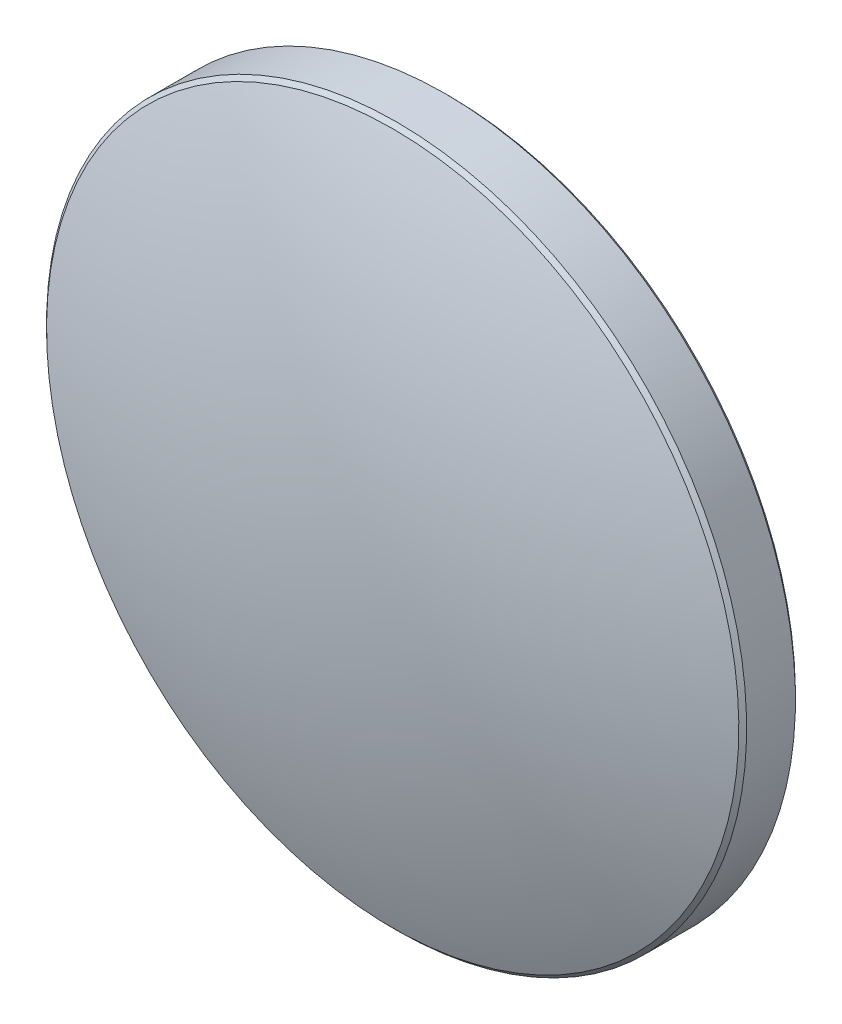
ISO-10303-21;
HEADER;
FILE_DESCRIPTION(('STEP AP214'),'2;1');
FILE_NAME('part.step','',(''),(''),'','','');
FILE_SCHEMA(('AUTOMOTIVE_DESIGN { 1 0 10303 214 1 1 1 1 }'));
ENDSEC;
DATA;
#1=APPLICATION_CONTEXT('core data for automotive mechanical design processes');
#2=APPLICATION_PROTOCOL_DEFINITION('international standard','automotive_design',2000,#1);
#3=PRODUCT_CONTEXT('',#1,'mechanical');
#4=PRODUCT('Part','Part','',(#3));
#5=PRODUCT_RELATED_PRODUCT_CATEGORY('part','',(#4));
#6=PRODUCT_DEFINITION_FORMATION('','',#4);
#7=PRODUCT_DEFINITION_CONTEXT('part definition',#1,'design');
#8=PRODUCT_DEFINITION('design','',#6,#7);
#9=PRODUCT_DEFINITION_SHAPE('','',#8);
#10=(LENGTH_UNIT() NAMED_UNIT(*) SI_UNIT(.MILLI.,.METRE.));
#11=(NAMED_UNIT(*) PLANE_ANGLE_UNIT() SI_UNIT($,.RADIAN.));
#12=(NAMED_UNIT(*) SI_UNIT($,.STERADIAN.) SOLID_ANGLE_UNIT());
#13=UNCERTAINTY_MEASURE_WITH_UNIT(LENGTH_MEASURE(1.E-05),#10,'distance_accuracy_value','');
#14=(GEOMETRIC_REPRESENTATION_CONTEXT(3) GLOBAL_UNCERTAINTY_ASSIGNED_CONTEXT((#13)) GLOBAL_UNIT_ASSIGNED_CONTEXT((#10,
#11,#12)) REPRESENTATION_CONTEXT('',''));
#15=CARTESIAN_POINT('',(0.,0.,0.));
#16=DIRECTION('',(0.,0.,1.));
#17=DIRECTION('',(1.,0.,0.));
#18=AXIS2_PLACEMENT_3D('',#15,#16,#17);
#19=CARTESIAN_POINT('',(0.,0.,-2.22));
#20=DIRECTION('',(0.,0.,-1.));
#21=DIRECTION('',(0.,1.,0.));
#22=AXIS2_PLACEMENT_3D('',#19,#20,#21);
#23=PLANE('',#22);
#24=CARTESIAN_POINT('',(0.,0.,-2.22));
#25=DIRECTION('',(0.,0.,-1.));
#26=DIRECTION('',(0.,1.,0.));
#27=AXIS2_PLACEMENT_3D('',#24,#25,#26);
#28=CIRCLE('',#27,12.5585786437627);
#29=CARTESIAN_POINT('',(0.,12.5585786437627,-2.22));
#30=VERTEX_POINT('',#29);
#31=EDGE_CURVE('E27',#30,#30,#28,.T.);
#32=ORIENTED_EDGE('',*,*,#31,.T.);
#33=EDGE_LOOP('',(#32));
#34=FACE_BOUND('',#33,.T.);
#35=ADVANCED_FACE('F13',(#34),#23,.T.);
#36=CARTESIAN_POINT('',(0.,0.,-32.032));
#37=DIRECTION('',(0.,0.,-1.));
#38=DIRECTION('',(0.,1.,0.));
#39=AXIS2_PLACEMENT_3D('',#36,#37,#38);
#40=SPHERICAL_SURFACE('',#39,34.252);
#41=CARTESIAN_POINT('',(0.,0.,-0.16537786259065));
#42=DIRECTION('',(0.,0.,-1.));
#43=DIRECTION('',(0.,1.,0.));
#44=AXIS2_PLACEMENT_3D('',#41,#42,#43);
#45=CIRCLE('',#44,12.5585786437627);
#46=CARTESIAN_POINT('',(0.,12.5585786437627,-0.165377862590646));
#47=VERTEX_POINT('',#46);
#48=EDGE_CURVE('E9',#47,#47,#45,.T.);
#49=ORIENTED_EDGE('',*,*,#48,.F.);
#50=EDGE_LOOP('',(#49));
#51=FACE_BOUND('',#50,.T.);
#52=ADVANCED_FACE('F46',(#51),#40,.T.);
#53=CARTESIAN_POINT('',(0.,0.,-0.306799218827957));
#54=DIRECTION('',(0.,0.,-1.));
#55=DIRECTION('',(0.,1.,0.));
#56=AXIS2_PLACEMENT_3D('',#53,#54,#55);
#57=CONICAL_SURFACE('',#56,12.7,0.785398163397462);
#58=ORIENTED_EDGE('',*,*,#48,.T.);
#59=EDGE_LOOP('',(#58));
#60=FACE_BOUND('',#59,.T.);
#61=CARTESIAN_POINT('',(0.,0.,-0.306799218827957));
#62=DIRECTION('',(0.,0.,-1.));
#63=DIRECTION('',(0.,1.,0.));
#64=AXIS2_PLACEMENT_3D('',#61,#62,#63);
#65=CIRCLE('',#64,12.7);
#66=CARTESIAN_POINT('',(0.,12.7,-0.306799218827954));
#67=VERTEX_POINT('',#66);
#68=EDGE_CURVE('E19',#67,#67,#65,.T.);
#69=ORIENTED_EDGE('',*,*,#68,.F.);
#70=EDGE_LOOP('',(#69));
#71=FACE_BOUND('',#70,.T.);
#72=ADVANCED_FACE('F43',(#60,#71),#57,.T.);
#73=CARTESIAN_POINT('',(0.,0.,-2.22));
#74=DIRECTION('',(0.,0.,-1.));
#75=DIRECTION('',(0.,1.,0.));
#76=AXIS2_PLACEMENT_3D('',#73,#74,#75);
#77=CYLINDRICAL_SURFACE('',#76,12.7);
#78=ORIENTED_EDGE('',*,*,#68,.T.);
#79=EDGE_LOOP('',(#78));
#80=FACE_BOUND('',#79,.T.);
#81=CARTESIAN_POINT('',(0.,0.,-2.07857864376269));
#82=DIRECTION('',(0.,0.,-1.));
#83=DIRECTION('',(0.,1.,0.));
#84=AXIS2_PLACEMENT_3D('',#81,#82,#83);
#85=CIRCLE('',#84,12.7);
#86=CARTESIAN_POINT('',(0.,12.7,-2.07857864376269));
#87=VERTEX_POINT('',#86);
#88=EDGE_CURVE('E23',#87,#87,#85,.T.);
#89=ORIENTED_EDGE('',*,*,#88,.F.);
#90=EDGE_LOOP('',(#89));
#91=FACE_BOUND('',#90,.T.);
#92=ADVANCED_FACE('F36',(#80,#91),#77,.T.);
#93=CARTESIAN_POINT('',(0.,0.,-2.22));
#94=DIRECTION('',(0.,0.,1.));
#95=DIRECTION('',(0.,-1.,0.));
#96=AXIS2_PLACEMENT_3D('',#93,#94,#95);
#97=CONICAL_SURFACE('',#96,12.5585786437627,0.785398163397441);
#98=ORIENTED_EDGE('',*,*,#88,.T.);
#99=EDGE_LOOP('',(#98));
#100=FACE_BOUND('',#99,.T.);
#101=ORIENTED_EDGE('',*,*,#31,.F.);
#102=EDGE_LOOP('',(#101));
#103=FACE_BOUND('',#102,.T.);
#104=ADVANCED_FACE('F34',(#100,#103),#97,.T.);
#105=CLOSED_SHELL('',(#35,#52,#72,#92,#104));
#106=MANIFOLD_SOLID_BREP('B1',#105);
#107=ADVANCED_BREP_SHAPE_REPRESENTATION('',(#18,#106),#14);
#108=SHAPE_DEFINITION_REPRESENTATION(#9,#107);
ENDSEC;
END-ISO-10303-21;
